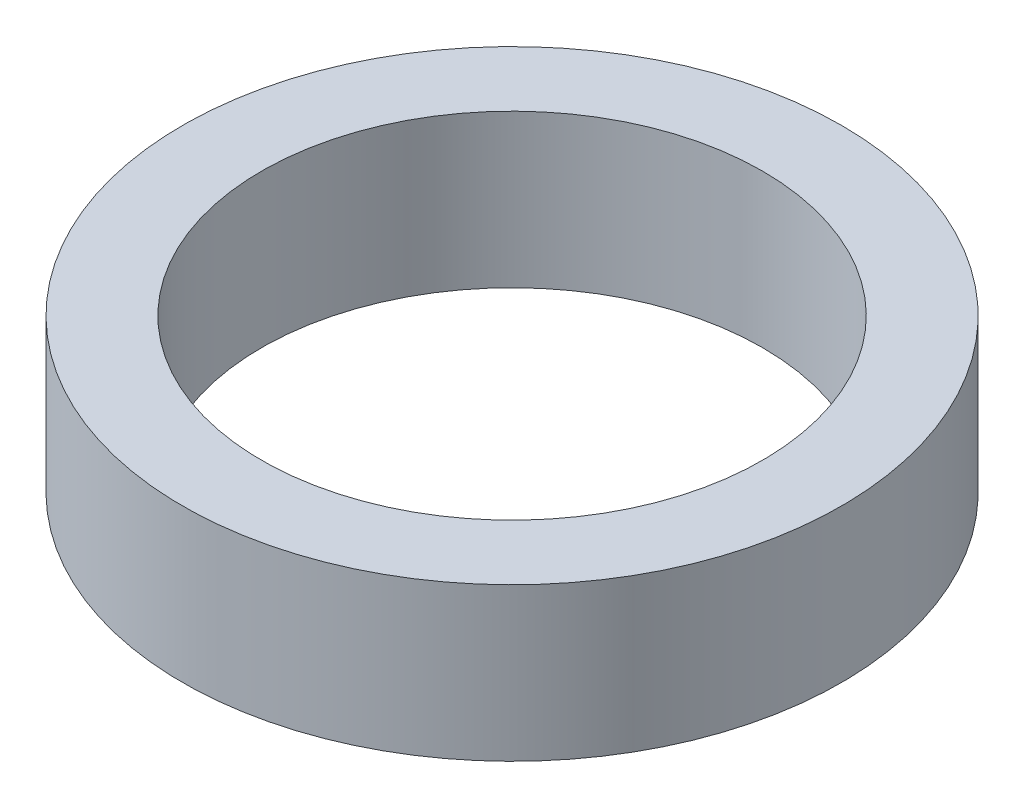
ISO-10303-21;
HEADER;
FILE_DESCRIPTION(('STEP AP214'),'2;1');
FILE_NAME('part.step','',(''),(''),'','','');
FILE_SCHEMA(('AUTOMOTIVE_DESIGN { 1 0 10303 214 1 1 1 1 }'));
ENDSEC;
DATA;
#1=APPLICATION_CONTEXT('core data for automotive mechanical design processes');
#2=APPLICATION_PROTOCOL_DEFINITION('international standard','automotive_design',2000,#1);
#3=PRODUCT_CONTEXT('',#1,'mechanical');
#4=PRODUCT('Part','Part','',(#3));
#5=PRODUCT_RELATED_PRODUCT_CATEGORY('part','',(#4));
#6=PRODUCT_DEFINITION_FORMATION('','',#4);
#7=PRODUCT_DEFINITION_CONTEXT('part definition',#1,'design');
#8=PRODUCT_DEFINITION('design','',#6,#7);
#9=PRODUCT_DEFINITION_SHAPE('','',#8);
#10=(LENGTH_UNIT() NAMED_UNIT(*) SI_UNIT(.MILLI.,.METRE.));
#11=(NAMED_UNIT(*) PLANE_ANGLE_UNIT() SI_UNIT($,.RADIAN.));
#12=(NAMED_UNIT(*) SI_UNIT($,.STERADIAN.) SOLID_ANGLE_UNIT());
#13=UNCERTAINTY_MEASURE_WITH_UNIT(LENGTH_MEASURE(1.E-05),#10,'distance_accuracy_value','');
#14=(GEOMETRIC_REPRESENTATION_CONTEXT(3) GLOBAL_UNCERTAINTY_ASSIGNED_CONTEXT((#13)) GLOBAL_UNIT_ASSIGNED_CONTEXT((#10,
#11,#12)) REPRESENTATION_CONTEXT('',''));
#15=CARTESIAN_POINT('',(0.,0.,0.));
#16=DIRECTION('',(0.,0.,1.));
#17=DIRECTION('',(1.,0.,0.));
#18=AXIS2_PLACEMENT_3D('',#15,#16,#17);
#19=CARTESIAN_POINT('',(0.,29.,0.));
#20=DIRECTION('',(0.,-1.,0.));
#21=DIRECTION('',(0.,0.,-1.));
#22=AXIS2_PLACEMENT_3D('',#19,#20,#21);
#23=CYLINDRICAL_SURFACE('',#22,62.5);
#24=CARTESIAN_POINT('',(0.,29.,0.));
#25=DIRECTION('',(0.,1.,0.));
#26=DIRECTION('',(0.,0.,1.));
#27=AXIS2_PLACEMENT_3D('',#24,#25,#26);
#28=CIRCLE('',#27,62.5);
#29=CARTESIAN_POINT('',(0.,29.,-62.5));
#30=VERTEX_POINT('',#29);
#31=EDGE_CURVE('E10',#30,#30,#28,.T.);
#32=CARTESIAN_POINT('',(0.,0.,0.));
#33=DIRECTION('',(0.,1.,0.));
#34=DIRECTION('',(0.,0.,1.));
#35=AXIS2_PLACEMENT_3D('',#32,#33,#34);
#36=CIRCLE('',#35,62.5);
#37=CARTESIAN_POINT('',(0.,0.,-62.5));
#38=VERTEX_POINT('',#37);
#39=EDGE_CURVE('E37',#38,#38,#36,.T.);
#40=CARTESIAN_POINT('',(0.,29.,-62.5));
#41=CARTESIAN_POINT('',(0.,28.6979166666667,-62.5));
#42=CARTESIAN_POINT('',(0.,28.3958333333333,-62.5));
#43=CARTESIAN_POINT('',(0.,27.7916666666667,-62.5));
#44=CARTESIAN_POINT('',(0.,27.4895833333333,-62.5));
#45=CARTESIAN_POINT('',(0.,26.8854166666667,-62.5));
#46=CARTESIAN_POINT('',(0.,26.5833333333333,-62.5));
#47=CARTESIAN_POINT('',(0.,25.9791666666667,-62.5));
#48=CARTESIAN_POINT('',(0.,25.6770833333333,-62.5));
#49=CARTESIAN_POINT('',(0.,25.0729166666667,-62.5));
#50=CARTESIAN_POINT('',(0.,24.7708333333333,-62.5));
#51=CARTESIAN_POINT('',(0.,24.1666666666667,-62.5));
#52=CARTESIAN_POINT('',(0.,23.8645833333333,-62.5));
#53=CARTESIAN_POINT('',(0.,23.2604166666667,-62.5));
#54=CARTESIAN_POINT('',(0.,22.9583333333333,-62.5));
#55=CARTESIAN_POINT('',(0.,22.3541666666667,-62.5));
#56=CARTESIAN_POINT('',(0.,22.0520833333333,-62.5));
#57=CARTESIAN_POINT('',(0.,21.4479166666667,-62.5));
#58=CARTESIAN_POINT('',(0.,21.1458333333333,-62.5));
#59=CARTESIAN_POINT('',(0.,20.5416666666667,-62.5));
#60=CARTESIAN_POINT('',(0.,20.2395833333333,-62.5));
#61=CARTESIAN_POINT('',(0.,19.6354166666667,-62.5));
#62=CARTESIAN_POINT('',(0.,19.3333333333333,-62.5));
#63=CARTESIAN_POINT('',(0.,18.7291666666667,-62.5));
#64=CARTESIAN_POINT('',(0.,18.4270833333333,-62.5));
#65=CARTESIAN_POINT('',(0.,17.8229166666667,-62.5));
#66=CARTESIAN_POINT('',(0.,17.5208333333333,-62.5));
#67=CARTESIAN_POINT('',(0.,16.9166666666667,-62.5));
#68=CARTESIAN_POINT('',(0.,16.6145833333333,-62.5));
#69=CARTESIAN_POINT('',(0.,16.0104166666667,-62.5));
#70=CARTESIAN_POINT('',(0.,15.7083333333333,-62.5));
#71=CARTESIAN_POINT('',(0.,15.1041666666667,-62.5));
#72=CARTESIAN_POINT('',(0.,14.8020833333333,-62.5));
#73=CARTESIAN_POINT('',(0.,14.1979166666667,-62.5));
#74=CARTESIAN_POINT('',(0.,13.8958333333333,-62.5));
#75=CARTESIAN_POINT('',(0.,13.2916666666667,-62.5));
#76=CARTESIAN_POINT('',(0.,12.9895833333333,-62.5));
#77=CARTESIAN_POINT('',(0.,12.3854166666667,-62.5));
#78=CARTESIAN_POINT('',(0.,12.0833333333333,-62.5));
#79=CARTESIAN_POINT('',(0.,11.4791666666667,-62.5));
#80=CARTESIAN_POINT('',(0.,11.1770833333333,-62.5));
#81=CARTESIAN_POINT('',(0.,10.5729166666667,-62.5));
#82=CARTESIAN_POINT('',(0.,10.2708333333333,-62.5));
#83=CARTESIAN_POINT('',(0.,9.66666666666667,-62.5));
#84=CARTESIAN_POINT('',(0.,9.36458333333333,-62.5));
#85=CARTESIAN_POINT('',(0.,8.76041666666667,-62.5));
#86=CARTESIAN_POINT('',(0.,8.45833333333333,-62.5));
#87=CARTESIAN_POINT('',(0.,7.85416666666667,-62.5));
#88=CARTESIAN_POINT('',(0.,7.55208333333333,-62.5));
#89=CARTESIAN_POINT('',(0.,6.94791666666667,-62.5));
#90=CARTESIAN_POINT('',(0.,6.64583333333333,-62.5));
#91=CARTESIAN_POINT('',(0.,6.04166666666667,-62.5));
#92=CARTESIAN_POINT('',(0.,5.73958333333333,-62.5));
#93=CARTESIAN_POINT('',(0.,5.13541666666667,-62.5));
#94=CARTESIAN_POINT('',(0.,4.83333333333333,-62.5));
#95=CARTESIAN_POINT('',(0.,4.22916666666667,-62.5));
#96=CARTESIAN_POINT('',(0.,3.92708333333333,-62.5));
#97=CARTESIAN_POINT('',(0.,3.32291666666667,-62.5));
#98=CARTESIAN_POINT('',(0.,3.02083333333333,-62.5));
#99=CARTESIAN_POINT('',(0.,2.41666666666667,-62.5));
#100=CARTESIAN_POINT('',(0.,2.11458333333333,-62.5));
#101=CARTESIAN_POINT('',(0.,1.51041666666667,-62.5));
#102=CARTESIAN_POINT('',(0.,1.20833333333333,-62.5));
#103=CARTESIAN_POINT('',(0.,0.604166666666667,-62.5));
#104=CARTESIAN_POINT('',(0.,0.302083333333333,-62.5));
#105=CARTESIAN_POINT('',(0.,0.,-62.5));
#106=B_SPLINE_CURVE_WITH_KNOTS('',3,(#40,#41,#42,#43,#44,#45,#46,#47,#48,#49,#50,#51,#52,#53,
#54,#55,#56,#57,#58,#59,#60,#61,#62,#63,#64,#65,#66,#67,#68,#69,#70,#71,#72,#73,#74,#75,#76,#77,
#78,#79,#80,#81,#82,#83,#84,#85,#86,#87,#88,#89,#90,#91,#92,#93,#94,#95,#96,#97,#98,#99,#100,
#101,#102,#103,#104,#105),.UNSPECIFIED.,.F.,.F.,(4,2,2,2,2,2,2,2,2,2,2,2,2,2,2,2,2,2,2,2,2,2,2,
2,2,2,2,2,2,2,2,2,4),(0.,0.906250000000001,1.8125,2.71875,3.625,4.53125,5.4375,6.34375,7.25,
8.15625,9.0625,9.96875,10.875,11.78125,12.6875,13.59375,14.5,15.40625,16.3125,17.21875,18.125,
19.03125,19.9375,20.84375,21.75,22.65625,23.5625,24.46875,25.375,26.28125,27.1875,28.09375,29.),.UNSPECIFIED.);
#107=EDGE_CURVE('BSEAM40',#30,#38,#106,.T.);
#108=ORIENTED_EDGE('',*,*,#31,.F.);
#109=ORIENTED_EDGE('',*,*,#39,.T.);
#110=ORIENTED_EDGE('',*,*,#107,.T.);
#111=ORIENTED_EDGE('',*,*,#107,.F.);
#112=EDGE_LOOP('',(#108,#110,#109,#111));
#113=FACE_BOUND('',#112,.T.);
#114=ADVANCED_FACE('F40',(#113),#23,.T.);
#115=CARTESIAN_POINT('',(0.,29.,0.));
#116=DIRECTION('',(0.,1.,0.));
#117=DIRECTION('',(0.,0.,1.));
#118=AXIS2_PLACEMENT_3D('',#115,#116,#117);
#119=PLANE('',#118);
#120=CARTESIAN_POINT('',(0.,29.,0.));
#121=DIRECTION('',(0.,1.,0.));
#122=DIRECTION('',(0.,0.,1.));
#123=AXIS2_PLACEMENT_3D('',#120,#121,#122);
#124=CIRCLE('',#123,47.5);
#125=CARTESIAN_POINT('',(0.,29.,-47.5));
#126=VERTEX_POINT('',#125);
#127=EDGE_CURVE('E50',#126,#126,#124,.T.);
#128=ORIENTED_EDGE('',*,*,#127,.F.);
#129=EDGE_LOOP('',(#128));
#130=FACE_BOUND('',#129,.T.);
#131=ORIENTED_EDGE('',*,*,#31,.T.);
#132=EDGE_LOOP('',(#131));
#133=FACE_BOUND('',#132,.T.);
#134=ADVANCED_FACE('F59',(#130,#133),#119,.T.);
#135=CARTESIAN_POINT('',(0.,0.,0.));
#136=DIRECTION('',(0.,1.,0.));
#137=DIRECTION('',(0.,0.,1.));
#138=AXIS2_PLACEMENT_3D('',#135,#136,#137);
#139=PLANE('',#138);
#140=CARTESIAN_POINT('',(0.,0.,0.));
#141=DIRECTION('',(0.,1.,0.));
#142=DIRECTION('',(0.,0.,1.));
#143=AXIS2_PLACEMENT_3D('',#140,#141,#142);
#144=CIRCLE('',#143,47.5);
#145=CARTESIAN_POINT('',(0.,0.,-47.5));
#146=VERTEX_POINT('',#145);
#147=EDGE_CURVE('E47',#146,#146,#144,.T.);
#148=ORIENTED_EDGE('',*,*,#147,.T.);
#149=EDGE_LOOP('',(#148));
#150=FACE_BOUND('',#149,.T.);
#151=ORIENTED_EDGE('',*,*,#39,.F.);
#152=EDGE_LOOP('',(#151));
#153=FACE_BOUND('',#152,.T.);
#154=ADVANCED_FACE('F58',(#150,#153),#139,.F.);
#155=CARTESIAN_POINT('',(0.,29.,0.));
#156=DIRECTION('',(0.,-1.,0.));
#157=DIRECTION('',(0.,0.,-1.));
#158=AXIS2_PLACEMENT_3D('',#155,#156,#157);
#159=CYLINDRICAL_SURFACE('',#158,47.5);
#160=CARTESIAN_POINT('',(0.,29.,-47.5));
#161=CARTESIAN_POINT('',(0.,28.6979166666667,-47.5));
#162=CARTESIAN_POINT('',(0.,28.3958333333333,-47.5));
#163=CARTESIAN_POINT('',(0.,27.7916666666667,-47.5));
#164=CARTESIAN_POINT('',(0.,27.4895833333333,-47.5));
#165=CARTESIAN_POINT('',(0.,26.8854166666667,-47.5));
#166=CARTESIAN_POINT('',(0.,26.5833333333333,-47.5));
#167=CARTESIAN_POINT('',(0.,25.9791666666667,-47.5));
#168=CARTESIAN_POINT('',(0.,25.6770833333333,-47.5));
#169=CARTESIAN_POINT('',(0.,25.0729166666667,-47.5));
#170=CARTESIAN_POINT('',(0.,24.7708333333333,-47.5));
#171=CARTESIAN_POINT('',(0.,24.1666666666667,-47.5));
#172=CARTESIAN_POINT('',(0.,23.8645833333333,-47.5));
#173=CARTESIAN_POINT('',(0.,23.2604166666667,-47.5));
#174=CARTESIAN_POINT('',(0.,22.9583333333333,-47.5));
#175=CARTESIAN_POINT('',(0.,22.3541666666667,-47.5));
#176=CARTESIAN_POINT('',(0.,22.0520833333333,-47.5));
#177=CARTESIAN_POINT('',(0.,21.4479166666667,-47.5));
#178=CARTESIAN_POINT('',(0.,21.1458333333333,-47.5));
#179=CARTESIAN_POINT('',(0.,20.5416666666667,-47.5));
#180=CARTESIAN_POINT('',(0.,20.2395833333333,-47.5));
#181=CARTESIAN_POINT('',(0.,19.6354166666667,-47.5));
#182=CARTESIAN_POINT('',(0.,19.3333333333333,-47.5));
#183=CARTESIAN_POINT('',(0.,18.7291666666667,-47.5));
#184=CARTESIAN_POINT('',(0.,18.4270833333333,-47.5));
#185=CARTESIAN_POINT('',(0.,17.8229166666667,-47.5));
#186=CARTESIAN_POINT('',(0.,17.5208333333333,-47.5));
#187=CARTESIAN_POINT('',(0.,16.9166666666667,-47.5));
#188=CARTESIAN_POINT('',(0.,16.6145833333333,-47.5));
#189=CARTESIAN_POINT('',(0.,16.0104166666667,-47.5));
#190=CARTESIAN_POINT('',(0.,15.7083333333333,-47.5));
#191=CARTESIAN_POINT('',(0.,15.1041666666667,-47.5));
#192=CARTESIAN_POINT('',(0.,14.8020833333333,-47.5));
#193=CARTESIAN_POINT('',(0.,14.1979166666667,-47.5));
#194=CARTESIAN_POINT('',(0.,13.8958333333333,-47.5));
#195=CARTESIAN_POINT('',(0.,13.2916666666667,-47.5));
#196=CARTESIAN_POINT('',(0.,12.9895833333333,-47.5));
#197=CARTESIAN_POINT('',(0.,12.3854166666667,-47.5));
#198=CARTESIAN_POINT('',(0.,12.0833333333333,-47.5));
#199=CARTESIAN_POINT('',(0.,11.4791666666667,-47.5));
#200=CARTESIAN_POINT('',(0.,11.1770833333333,-47.5));
#201=CARTESIAN_POINT('',(0.,10.5729166666667,-47.5));
#202=CARTESIAN_POINT('',(0.,10.2708333333333,-47.5));
#203=CARTESIAN_POINT('',(0.,9.66666666666667,-47.5));
#204=CARTESIAN_POINT('',(0.,9.36458333333333,-47.5));
#205=CARTESIAN_POINT('',(0.,8.76041666666667,-47.5));
#206=CARTESIAN_POINT('',(0.,8.45833333333333,-47.5));
#207=CARTESIAN_POINT('',(0.,7.85416666666667,-47.5));
#208=CARTESIAN_POINT('',(0.,7.55208333333333,-47.5));
#209=CARTESIAN_POINT('',(0.,6.94791666666667,-47.5));
#210=CARTESIAN_POINT('',(0.,6.64583333333333,-47.5));
#211=CARTESIAN_POINT('',(0.,6.04166666666667,-47.5));
#212=CARTESIAN_POINT('',(0.,5.73958333333333,-47.5));
#213=CARTESIAN_POINT('',(0.,5.13541666666667,-47.5));
#214=CARTESIAN_POINT('',(0.,4.83333333333333,-47.5));
#215=CARTESIAN_POINT('',(0.,4.22916666666667,-47.5));
#216=CARTESIAN_POINT('',(0.,3.92708333333333,-47.5));
#217=CARTESIAN_POINT('',(0.,3.32291666666667,-47.5));
#218=CARTESIAN_POINT('',(0.,3.02083333333333,-47.5));
#219=CARTESIAN_POINT('',(0.,2.41666666666667,-47.5));
#220=CARTESIAN_POINT('',(0.,2.11458333333333,-47.5));
#221=CARTESIAN_POINT('',(0.,1.51041666666667,-47.5));
#222=CARTESIAN_POINT('',(0.,1.20833333333333,-47.5));
#223=CARTESIAN_POINT('',(0.,0.604166666666667,-47.5));
#224=CARTESIAN_POINT('',(0.,0.302083333333333,-47.5));
#225=CARTESIAN_POINT('',(0.,0.,-47.5));
#226=B_SPLINE_CURVE_WITH_KNOTS('',3,(#160,#161,#162,#163,#164,#165,#166,#167,#168,#169,#170,
#171,#172,#173,#174,#175,#176,#177,#178,#179,#180,#181,#182,#183,#184,#185,#186,#187,#188,#189,
#190,#191,#192,#193,#194,#195,#196,#197,#198,#199,#200,#201,#202,#203,#204,#205,#206,#207,#208,
#209,#210,#211,#212,#213,#214,#215,#216,#217,#218,#219,#220,#221,#222,#223,#224,#225),
.UNSPECIFIED.,.F.,.F.,(4,2,2,2,2,2,2,2,2,2,2,2,2,2,2,2,2,2,2,2,2,2,2,2,2,2,2,2,2,2,2,2,4),(0.,
0.906249999999997,1.8125,2.71875,3.625,4.53125,5.4375,6.34375,7.25,8.15625,9.0625,9.96875,
10.875,11.78125,12.6875,13.59375,14.5,15.40625,16.3125,17.21875,18.125,19.03125,19.9375,
20.84375,21.75,22.65625,23.5625,24.46875,25.375,26.28125,27.1875,28.09375,29.),.UNSPECIFIED.);
#227=EDGE_CURVE('BSEAM54',#126,#146,#226,.T.);
#228=ORIENTED_EDGE('',*,*,#127,.T.);
#229=ORIENTED_EDGE('',*,*,#147,.F.);
#230=ORIENTED_EDGE('',*,*,#227,.T.);
#231=ORIENTED_EDGE('',*,*,#227,.F.);
#232=EDGE_LOOP('',(#228,#230,#229,#231));
#233=FACE_BOUND('',#232,.T.);
#234=ADVANCED_FACE('F54',(#233),#159,.F.);
#235=CLOSED_SHELL('',(#114,#134,#154,#234));
#236=MANIFOLD_SOLID_BREP('B2',#235);
#237=ADVANCED_BREP_SHAPE_REPRESENTATION('',(#18,#236),#14);
#238=SHAPE_DEFINITION_REPRESENTATION(#9,#237);
ENDSEC;
END-ISO-10303-21;
